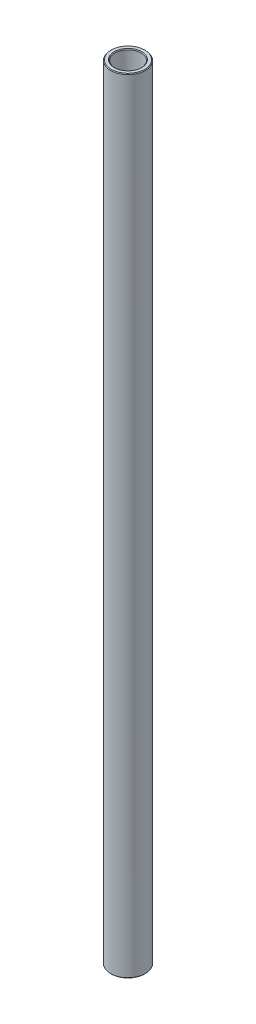
ISO-10303-21;
HEADER;
FILE_DESCRIPTION(('STEP AP214'),'2;1');
FILE_NAME('part.step','',(''),(''),'','','');
FILE_SCHEMA(('AUTOMOTIVE_DESIGN { 1 0 10303 214 1 1 1 1 }'));
ENDSEC;
DATA;
#1=APPLICATION_CONTEXT('core data for automotive mechanical design processes');
#2=APPLICATION_PROTOCOL_DEFINITION('international standard','automotive_design',2000,#1);
#3=PRODUCT_CONTEXT('',#1,'mechanical');
#4=PRODUCT('Part','Part','',(#3));
#5=PRODUCT_RELATED_PRODUCT_CATEGORY('part','',(#4));
#6=PRODUCT_DEFINITION_FORMATION('','',#4);
#7=PRODUCT_DEFINITION_CONTEXT('part definition',#1,'design');
#8=PRODUCT_DEFINITION('design','',#6,#7);
#9=PRODUCT_DEFINITION_SHAPE('','',#8);
#10=(LENGTH_UNIT() NAMED_UNIT(*) SI_UNIT(.MILLI.,.METRE.));
#11=(NAMED_UNIT(*) PLANE_ANGLE_UNIT() SI_UNIT($,.RADIAN.));
#12=(NAMED_UNIT(*) SI_UNIT($,.STERADIAN.) SOLID_ANGLE_UNIT());
#13=UNCERTAINTY_MEASURE_WITH_UNIT(LENGTH_MEASURE(1.E-05),#10,'distance_accuracy_value','');
#14=(GEOMETRIC_REPRESENTATION_CONTEXT(3) GLOBAL_UNCERTAINTY_ASSIGNED_CONTEXT((#13)) GLOBAL_UNIT_ASSIGNED_CONTEXT((#10,
#11,#12)) REPRESENTATION_CONTEXT('',''));
#15=CARTESIAN_POINT('',(0.,0.,0.));
#16=DIRECTION('',(0.,0.,1.));
#17=DIRECTION('',(1.,0.,0.));
#18=AXIS2_PLACEMENT_3D('',#15,#16,#17);
#19=CARTESIAN_POINT('',(0.,11.60859375,0.));
#20=DIRECTION('',(0.,1.,0.));
#21=DIRECTION('',(-1.,0.,0.));
#22=AXIS2_PLACEMENT_3D('',#19,#20,#21);
#23=CYLINDRICAL_SURFACE('',#22,4.7625);
#24=CARTESIAN_POINT('',(0.,-142.621,0.));
#25=DIRECTION('',(0.,1.,0.));
#26=DIRECTION('',(-1.,0.,0.));
#27=AXIS2_PLACEMENT_3D('',#24,#25,#26);
#28=CIRCLE('',#27,4.7625);
#29=CARTESIAN_POINT('',(-4.76250000000002,-142.621,0.));
#30=VERTEX_POINT('',#29);
#31=EDGE_CURVE('E51',#30,#30,#28,.F.);
#32=ORIENTED_EDGE('',*,*,#31,.T.);
#33=EDGE_LOOP('',(#32));
#34=FACE_BOUND('',#33,.T.);
#35=CARTESIAN_POINT('',(0.,142.621,0.));
#36=DIRECTION('',(0.,-1.,0.));
#37=DIRECTION('',(1.,0.,0.));
#38=AXIS2_PLACEMENT_3D('',#35,#36,#37);
#39=CIRCLE('',#38,4.7625);
#40=CARTESIAN_POINT('',(4.76250000000002,142.621,0.));
#41=VERTEX_POINT('',#40);
#42=EDGE_CURVE('E54',#41,#41,#39,.F.);
#43=ORIENTED_EDGE('',*,*,#42,.T.);
#44=EDGE_LOOP('',(#43));
#45=FACE_BOUND('',#44,.T.);
#46=ADVANCED_FACE('F31',(#34,#45),#23,.F.);
#47=CARTESIAN_POINT('',(4.76249999999999,142.875,0.));
#48=DIRECTION('',(0.,-1.,0.));
#49=DIRECTION('',(1.,0.,0.));
#50=AXIS2_PLACEMENT_3D('',#47,#48,#49);
#51=PLANE('',#50);
#52=CARTESIAN_POINT('',(0.,142.875,0.));
#53=DIRECTION('',(0.,-1.,0.));
#54=DIRECTION('',(1.,0.,0.));
#55=AXIS2_PLACEMENT_3D('',#52,#53,#54);
#56=CIRCLE('',#55,6.09599999999996);
#57=CARTESIAN_POINT('',(6.09599999999998,142.875,0.));
#58=VERTEX_POINT('',#57);
#59=EDGE_CURVE('E10',#58,#58,#56,.F.);
#60=ORIENTED_EDGE('',*,*,#59,.T.);
#61=EDGE_LOOP('',(#60));
#62=FACE_BOUND('',#61,.T.);
#63=CARTESIAN_POINT('',(0.,142.875,0.));
#64=DIRECTION('',(0.,-1.,0.));
#65=DIRECTION('',(1.,0.,0.));
#66=AXIS2_PLACEMENT_3D('',#63,#64,#65);
#67=CIRCLE('',#66,5.01650000000001);
#68=CARTESIAN_POINT('',(5.01650000000003,142.875,0.));
#69=VERTEX_POINT('',#68);
#70=EDGE_CURVE('E38',#69,#69,#67,.T.);
#71=ORIENTED_EDGE('',*,*,#70,.T.);
#72=EDGE_LOOP('',(#71));
#73=FACE_BOUND('',#72,.T.);
#74=ADVANCED_FACE('F77',(#62,#73),#51,.F.);
#75=CARTESIAN_POINT('',(0.,11.60859375,0.));
#76=DIRECTION('',(0.,1.,0.));
#77=DIRECTION('',(-1.,0.,0.));
#78=AXIS2_PLACEMENT_3D('',#75,#76,#77);
#79=CYLINDRICAL_SURFACE('',#78,6.35);
#80=CARTESIAN_POINT('',(0.,-142.621,0.));
#81=DIRECTION('',(0.,1.,0.));
#82=DIRECTION('',(-1.,0.,0.));
#83=AXIS2_PLACEMENT_3D('',#80,#81,#82);
#84=CIRCLE('',#83,6.35);
#85=CARTESIAN_POINT('',(-6.35000000000002,-142.621,0.));
#86=VERTEX_POINT('',#85);
#87=EDGE_CURVE('E42',#86,#86,#84,.T.);
#88=ORIENTED_EDGE('',*,*,#87,.T.);
#89=EDGE_LOOP('',(#88));
#90=FACE_BOUND('',#89,.T.);
#91=CARTESIAN_POINT('',(0.,142.621,0.));
#92=DIRECTION('',(0.,-1.,0.));
#93=DIRECTION('',(1.,0.,0.));
#94=AXIS2_PLACEMENT_3D('',#91,#92,#93);
#95=CIRCLE('',#94,6.35);
#96=CARTESIAN_POINT('',(6.35000000000002,142.621,0.));
#97=VERTEX_POINT('',#96);
#98=EDGE_CURVE('E46',#97,#97,#95,.T.);
#99=ORIENTED_EDGE('',*,*,#98,.T.);
#100=EDGE_LOOP('',(#99));
#101=FACE_BOUND('',#100,.T.);
#102=ADVANCED_FACE('F74',(#90,#101),#79,.T.);
#103=CARTESIAN_POINT('',(6.35000000000002,-142.875,0.));
#104=DIRECTION('',(0.,1.,0.));
#105=DIRECTION('',(-1.,0.,0.));
#106=AXIS2_PLACEMENT_3D('',#103,#104,#105);
#107=PLANE('',#106);
#108=CARTESIAN_POINT('',(0.,-142.875,0.));
#109=DIRECTION('',(0.,1.,0.));
#110=DIRECTION('',(-1.,0.,0.));
#111=AXIS2_PLACEMENT_3D('',#108,#109,#110);
#112=CIRCLE('',#111,5.01650000000006);
#113=CARTESIAN_POINT('',(-5.01650000000008,-142.875,0.));
#114=VERTEX_POINT('',#113);
#115=EDGE_CURVE('E57',#114,#114,#112,.T.);
#116=ORIENTED_EDGE('',*,*,#115,.T.);
#117=EDGE_LOOP('',(#116));
#118=FACE_BOUND('',#117,.T.);
#119=CARTESIAN_POINT('',(0.,-142.875,0.));
#120=DIRECTION('',(0.,1.,0.));
#121=DIRECTION('',(-1.,0.,0.));
#122=AXIS2_PLACEMENT_3D('',#119,#120,#121);
#123=CIRCLE('',#122,6.09599999999999);
#124=CARTESIAN_POINT('',(-6.09600000000001,-142.875,0.));
#125=VERTEX_POINT('',#124);
#126=EDGE_CURVE('E60',#125,#125,#123,.F.);
#127=ORIENTED_EDGE('',*,*,#126,.T.);
#128=EDGE_LOOP('',(#127));
#129=FACE_BOUND('',#128,.T.);
#130=ADVANCED_FACE('F64',(#118,#129),#107,.F.);
#131=CARTESIAN_POINT('',(0.,-142.875,0.));
#132=DIRECTION('',(0.,-1.,0.));
#133=DIRECTION('',(1.,0.,0.));
#134=AXIS2_PLACEMENT_3D('',#131,#132,#133);
#135=CONICAL_SURFACE('',#134,5.01650000000006,0.785398163397505);
#136=ORIENTED_EDGE('',*,*,#31,.F.);
#137=EDGE_LOOP('',(#136));
#138=FACE_BOUND('',#137,.T.);
#139=ORIENTED_EDGE('',*,*,#115,.F.);
#140=EDGE_LOOP('',(#139));
#141=FACE_BOUND('',#140,.T.);
#142=ADVANCED_FACE('F70',(#138,#141),#135,.F.);
#143=CARTESIAN_POINT('',(0.,-142.621,0.));
#144=DIRECTION('',(0.,1.,0.));
#145=DIRECTION('',(-1.,0.,0.));
#146=AXIS2_PLACEMENT_3D('',#143,#144,#145);
#147=CONICAL_SURFACE('',#146,6.35,0.785398163397515);
#148=ORIENTED_EDGE('',*,*,#126,.F.);
#149=EDGE_LOOP('',(#148));
#150=FACE_BOUND('',#149,.T.);
#151=ORIENTED_EDGE('',*,*,#87,.F.);
#152=EDGE_LOOP('',(#151));
#153=FACE_BOUND('',#152,.T.);
#154=ADVANCED_FACE('F66',(#150,#153),#147,.T.);
#155=CARTESIAN_POINT('',(0.,142.875,0.));
#156=DIRECTION('',(0.,-1.,0.));
#157=DIRECTION('',(1.,0.,0.));
#158=AXIS2_PLACEMENT_3D('',#155,#156,#157);
#159=CONICAL_SURFACE('',#158,6.09599999999996,0.78539816339746);
#160=ORIENTED_EDGE('',*,*,#98,.F.);
#161=EDGE_LOOP('',(#160));
#162=FACE_BOUND('',#161,.T.);
#163=ORIENTED_EDGE('',*,*,#59,.F.);
#164=EDGE_LOOP('',(#163));
#165=FACE_BOUND('',#164,.T.);
#166=ADVANCED_FACE('F69',(#162,#165),#159,.T.);
#167=CARTESIAN_POINT('',(0.,142.621,0.));
#168=DIRECTION('',(0.,1.,0.));
#169=DIRECTION('',(-1.,0.,0.));
#170=AXIS2_PLACEMENT_3D('',#167,#168,#169);
#171=CONICAL_SURFACE('',#170,4.7625,0.785398163397559);
#172=ORIENTED_EDGE('',*,*,#70,.F.);
#173=EDGE_LOOP('',(#172));
#174=FACE_BOUND('',#173,.T.);
#175=ORIENTED_EDGE('',*,*,#42,.F.);
#176=EDGE_LOOP('',(#175));
#177=FACE_BOUND('',#176,.T.);
#178=ADVANCED_FACE('F33',(#174,#177),#171,.F.);
#179=CLOSED_SHELL('',(#46,#74,#102,#130,#142,#154,#166,#178));
#180=MANIFOLD_SOLID_BREP('B2',#179);
#181=ADVANCED_BREP_SHAPE_REPRESENTATION('',(#18,#180),#14);
#182=SHAPE_DEFINITION_REPRESENTATION(#9,#181);
ENDSEC;
END-ISO-10303-21;
